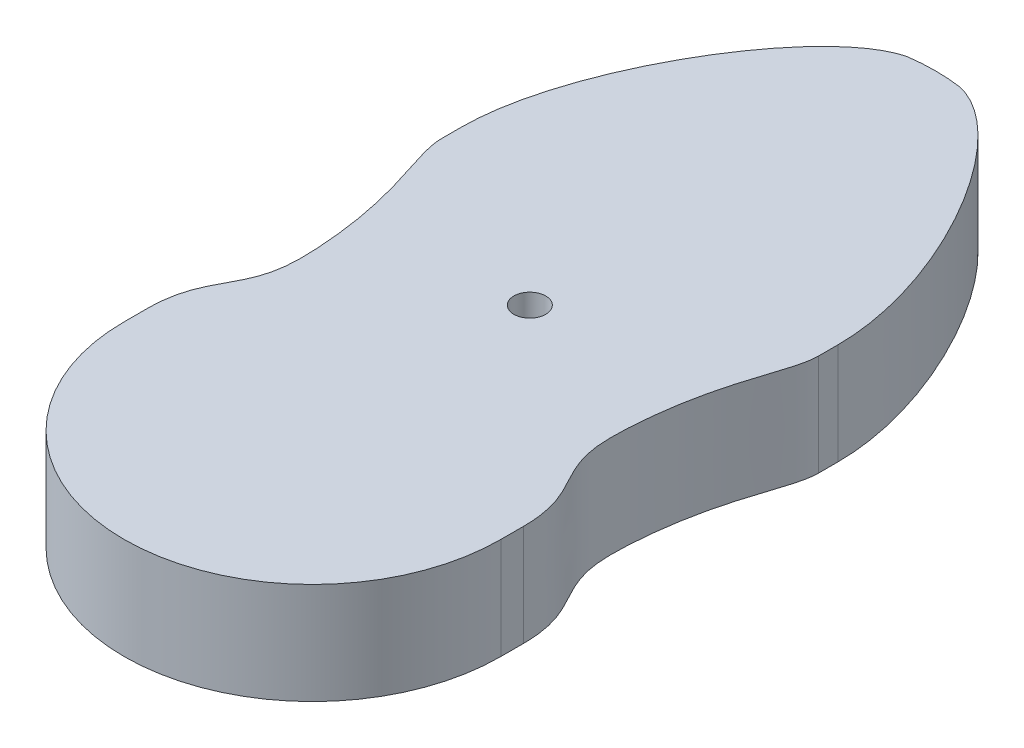
ISO-10303-21;
HEADER;
FILE_DESCRIPTION(('STEP AP214'),'2;1');
FILE_NAME('part.step','',(''),(''),'','','');
FILE_SCHEMA(('AUTOMOTIVE_DESIGN { 1 0 10303 214 1 1 1 1 }'));
ENDSEC;
DATA;
#1=APPLICATION_CONTEXT('core data for automotive mechanical design processes');
#2=APPLICATION_PROTOCOL_DEFINITION('international standard','automotive_design',2000,#1);
#3=PRODUCT_CONTEXT('',#1,'mechanical');
#4=PRODUCT('Part','Part','',(#3));
#5=PRODUCT_RELATED_PRODUCT_CATEGORY('part','',(#4));
#6=PRODUCT_DEFINITION_FORMATION('','',#4);
#7=PRODUCT_DEFINITION_CONTEXT('part definition',#1,'design');
#8=PRODUCT_DEFINITION('design','',#6,#7);
#9=PRODUCT_DEFINITION_SHAPE('','',#8);
#10=(LENGTH_UNIT() NAMED_UNIT(*) SI_UNIT(.MILLI.,.METRE.));
#11=(NAMED_UNIT(*) PLANE_ANGLE_UNIT() SI_UNIT($,.RADIAN.));
#12=(NAMED_UNIT(*) SI_UNIT($,.STERADIAN.) SOLID_ANGLE_UNIT());
#13=UNCERTAINTY_MEASURE_WITH_UNIT(LENGTH_MEASURE(1.E-05),#10,'distance_accuracy_value','');
#14=(GEOMETRIC_REPRESENTATION_CONTEXT(3) GLOBAL_UNCERTAINTY_ASSIGNED_CONTEXT((#13)) GLOBAL_UNIT_ASSIGNED_CONTEXT((#10,
#11,#12)) REPRESENTATION_CONTEXT('',''));
#15=CARTESIAN_POINT('',(0.,0.,0.));
#16=DIRECTION('',(0.,0.,1.));
#17=DIRECTION('',(1.,0.,0.));
#18=AXIS2_PLACEMENT_3D('',#15,#16,#17);
#19=CARTESIAN_POINT('',(65.,35.,-34.564378511684));
#20=CARTESIAN_POINT('',(65.,35.,-25.3044466184504));
#21=CARTESIAN_POINT('',(54.8759380217189,35.,-10.0008817095649));
#22=CARTESIAN_POINT('',(52.5082242131624,35.,44.6661183433651));
#23=CARTESIAN_POINT('',(65.0000000000032,35.,48.3308469707559));
#24=CARTESIAN_POINT('',(65.,35.,67.1772101581781));
#25=B_SPLINE_CURVE_WITH_KNOTS('',3,(#19,#20,#21,#22,#23,#24),.UNSPECIFIED.,.F.,.F.,(4,1,1,4),
(0.,0.557561401782111,0.65756140178211,1.),.UNSPECIFIED.);
#26=DIRECTION('',(0.,-1.,0.));
#27=VECTOR('',#26,1.);
#28=SURFACE_OF_LINEAR_EXTRUSION('',#25,#27);
#29=CARTESIAN_POINT('',(65.,0.,-34.564378511684));
#30=CARTESIAN_POINT('',(65.,0.,-25.3044466184504));
#31=CARTESIAN_POINT('',(54.8759380217189,0.,-10.0008817095649));
#32=CARTESIAN_POINT('',(52.5082242131624,0.,44.6661183433651));
#33=CARTESIAN_POINT('',(65.0000000000032,0.,48.3308469707559));
#34=CARTESIAN_POINT('',(65.,0.,67.1772101581781));
#35=B_SPLINE_CURVE_WITH_KNOTS('',3,(#29,#30,#31,#32,#33,#34),.UNSPECIFIED.,.F.,.F.,(4,1,1,4),
(0.,0.557561401782111,0.65756140178211,1.),.UNSPECIFIED.);
#36=CARTESIAN_POINT('',(65.0000000000001,0.,-34.564378511684));
#37=VERTEX_POINT('',#36);
#38=CARTESIAN_POINT('',(65.0000000000001,0.,67.1772101581781));
#39=VERTEX_POINT('',#38);
#40=EDGE_CURVE('E160',#37,#39,#35,.T.);
#41=ORIENTED_EDGE('',*,*,#40,.F.);
#42=DIRECTION('',(0.,-1.,0.));
#43=VECTOR('',#42,1.);
#44=CARTESIAN_POINT('',(65.0000000000001,35.,-34.564378511684));
#45=LINE('',#44,#43);
#46=CARTESIAN_POINT('',(65.0000000000001,35.,-34.564378511684));
#47=VERTEX_POINT('',#46);
#48=EDGE_CURVE('E11',#47,#37,#45,.T.);
#49=ORIENTED_EDGE('',*,*,#48,.F.);
#50=CARTESIAN_POINT('',(65.0000000000001,35.,67.1772101581781));
#51=VERTEX_POINT('',#50);
#52=EDGE_CURVE('E234',#47,#51,#25,.T.);
#53=ORIENTED_EDGE('',*,*,#52,.T.);
#54=DIRECTION('',(0.,-1.,0.));
#55=VECTOR('',#54,1.);
#56=CARTESIAN_POINT('',(65.0000000000001,35.,67.1772101581781));
#57=LINE('',#56,#55);
#58=EDGE_CURVE('E63',#51,#39,#57,.T.);
#59=ORIENTED_EDGE('',*,*,#58,.T.);
#60=EDGE_LOOP('',(#41,#49,#53,#59));
#61=FACE_BOUND('',#60,.T.);
#62=ADVANCED_FACE('F43',(#61),#28,.T.);
#63=CARTESIAN_POINT('',(65.0000000000001,35.,0.));
#64=DIRECTION('',(1.,0.,0.));
#65=DIRECTION('',(0.,0.,-1.));
#66=AXIS2_PLACEMENT_3D('',#63,#64,#65);
#67=PLANE('',#66);
#68=DIRECTION('',(0.,0.,1.));
#69=VECTOR('',#68,1.);
#70=CARTESIAN_POINT('',(65.0000000000001,0.,0.));
#71=LINE('',#70,#69);
#72=CARTESIAN_POINT('',(65.0000000000001,0.,-41.3132072498512));
#73=VERTEX_POINT('',#72);
#74=EDGE_CURVE('E165',#73,#37,#71,.T.);
#75=ORIENTED_EDGE('',*,*,#74,.F.);
#76=DIRECTION('',(0.,-1.,0.));
#77=VECTOR('',#76,1.);
#78=CARTESIAN_POINT('',(65.0000000000001,35.,-41.3132072498512));
#79=LINE('',#78,#77);
#80=CARTESIAN_POINT('',(65.0000000000001,35.,-41.3132072498512));
#81=VERTEX_POINT('',#80);
#82=EDGE_CURVE('E52',#81,#73,#79,.T.);
#83=ORIENTED_EDGE('',*,*,#82,.F.);
#84=DIRECTION('',(0.,0.,1.));
#85=VECTOR('',#84,1.);
#86=CARTESIAN_POINT('',(65.0000000000001,35.,0.));
#87=LINE('',#86,#85);
#88=EDGE_CURVE('E154',#81,#47,#87,.T.);
#89=ORIENTED_EDGE('',*,*,#88,.T.);
#90=ORIENTED_EDGE('',*,*,#48,.T.);
#91=EDGE_LOOP('',(#75,#83,#89,#90));
#92=FACE_BOUND('',#91,.T.);
#93=ADVANCED_FACE('F230',(#92),#67,.T.);
#94=CARTESIAN_POINT('',(65.,35.,-41.3132072498512));
#95=CARTESIAN_POINT('',(65.,35.,-81.2860596841783));
#96=CARTESIAN_POINT('',(28.4072122796697,35.,-139.74464823659));
#97=CARTESIAN_POINT('',(5.75591215379472,35.,-139.744648236588));
#98=B_SPLINE_CURVE_WITH_KNOTS('',3,(#94,#95,#96,#97),.UNSPECIFIED.,.F.,.F.,(4,4),(0.,1.),.UNSPECIFIED.);
#99=DIRECTION('',(0.,-1.,0.));
#100=VECTOR('',#99,1.);
#101=SURFACE_OF_LINEAR_EXTRUSION('',#98,#100);
#102=CARTESIAN_POINT('',(65.,0.,-41.3132072498512));
#103=CARTESIAN_POINT('',(65.,0.,-81.2860596841783));
#104=CARTESIAN_POINT('',(28.4072122796697,0.,-139.74464823659));
#105=CARTESIAN_POINT('',(5.75591215379472,0.,-139.744648236588));
#106=B_SPLINE_CURVE_WITH_KNOTS('',3,(#102,#103,#104,#105),.UNSPECIFIED.,.F.,.F.,(4,4),(0.,1.),.UNSPECIFIED.);
#107=CARTESIAN_POINT('',(8.99406307241884,0.,-139.374737509751));
#108=VERTEX_POINT('',#107);
#109=EDGE_CURVE('E172',#73,#108,#106,.T.);
#110=ORIENTED_EDGE('',*,*,#109,.T.);
#111=DIRECTION('',(0.,-1.,0.));
#112=VECTOR('',#111,1.);
#113=CARTESIAN_POINT('',(8.99406307241884,35.,-139.374737509751));
#114=LINE('',#113,#112);
#115=CARTESIAN_POINT('',(8.99406307241884,35.,-139.374737509751));
#116=VERTEX_POINT('',#115);
#117=EDGE_CURVE('E215',#116,#108,#114,.T.);
#118=ORIENTED_EDGE('',*,*,#117,.F.);
#119=EDGE_CURVE('E222',#81,#116,#98,.T.);
#120=ORIENTED_EDGE('',*,*,#119,.F.);
#121=ORIENTED_EDGE('',*,*,#82,.T.);
#122=EDGE_LOOP('',(#110,#118,#120,#121));
#123=FACE_BOUND('',#122,.T.);
#124=ADVANCED_FACE('F220',(#123),#101,.F.);
#125=CARTESIAN_POINT('',(0.,35.,-75.));
#126=DIRECTION('',(0.,-1.,0.));
#127=DIRECTION('',(0.,0.,-1.));
#128=AXIS2_PLACEMENT_3D('',#125,#126,#127);
#129=CYLINDRICAL_SURFACE('',#128,65.);
#130=CARTESIAN_POINT('',(0.,0.,-75.));
#131=DIRECTION('',(0.,1.,0.));
#132=DIRECTION('',(0.,0.,1.));
#133=AXIS2_PLACEMENT_3D('',#130,#131,#132);
#134=CIRCLE('',#133,65.);
#135=CARTESIAN_POINT('',(-8.99406307241938,0.,-139.374737509751));
#136=VERTEX_POINT('',#135);
#137=EDGE_CURVE('E177',#108,#136,#134,.T.);
#138=ORIENTED_EDGE('',*,*,#137,.T.);
#139=DIRECTION('',(0.,-1.,0.));
#140=VECTOR('',#139,1.);
#141=CARTESIAN_POINT('',(-8.99406307241938,35.,-139.374737509751));
#142=LINE('',#141,#140);
#143=CARTESIAN_POINT('',(-8.99406307241938,35.,-139.374737509751));
#144=VERTEX_POINT('',#143);
#145=EDGE_CURVE('E213',#144,#136,#142,.T.);
#146=ORIENTED_EDGE('',*,*,#145,.F.);
#147=CARTESIAN_POINT('',(0.,35.,-75.));
#148=DIRECTION('',(0.,1.,0.));
#149=DIRECTION('',(0.,0.,1.));
#150=AXIS2_PLACEMENT_3D('',#147,#148,#149);
#151=CIRCLE('',#150,65.);
#152=EDGE_CURVE('E249',#116,#144,#151,.T.);
#153=ORIENTED_EDGE('',*,*,#152,.F.);
#154=ORIENTED_EDGE('',*,*,#117,.T.);
#155=EDGE_LOOP('',(#138,#146,#153,#154));
#156=FACE_BOUND('',#155,.T.);
#157=ADVANCED_FACE('F256',(#156),#129,.T.);
#158=CARTESIAN_POINT('',(-65.,35.,-41.3132072498512));
#159=CARTESIAN_POINT('',(-65.,35.,-81.2860596841783));
#160=CARTESIAN_POINT('',(-28.4072122796697,35.,-139.74464823659));
#161=CARTESIAN_POINT('',(-5.75591215379472,35.,-139.744648236588));
#162=B_SPLINE_CURVE_WITH_KNOTS('',3,(#158,#159,#160,#161),.UNSPECIFIED.,.F.,.F.,(4,4),(0.,1.),.UNSPECIFIED.);
#163=DIRECTION('',(0.,-1.,0.));
#164=VECTOR('',#163,1.);
#165=SURFACE_OF_LINEAR_EXTRUSION('',#162,#164);
#166=CARTESIAN_POINT('',(-65.,0.,-41.3132072498512));
#167=CARTESIAN_POINT('',(-65.,0.,-81.2860596841783));
#168=CARTESIAN_POINT('',(-28.4072122796697,0.,-139.74464823659));
#169=CARTESIAN_POINT('',(-5.75591215379472,0.,-139.744648236588));
#170=B_SPLINE_CURVE_WITH_KNOTS('',3,(#166,#167,#168,#169),.UNSPECIFIED.,.F.,.F.,(4,4),(0.,1.),.UNSPECIFIED.);
#171=CARTESIAN_POINT('',(-65.,0.,-41.3132072498512));
#172=VERTEX_POINT('',#171);
#173=EDGE_CURVE('E183',#172,#136,#170,.T.);
#174=ORIENTED_EDGE('',*,*,#173,.F.);
#175=DIRECTION('',(0.,-1.,0.));
#176=VECTOR('',#175,1.);
#177=CARTESIAN_POINT('',(-65.,35.,-41.3132072498512));
#178=LINE('',#177,#176);
#179=CARTESIAN_POINT('',(-65.,35.,-41.3132072498512));
#180=VERTEX_POINT('',#179);
#181=EDGE_CURVE('E211',#180,#172,#178,.T.);
#182=ORIENTED_EDGE('',*,*,#181,.F.);
#183=EDGE_CURVE('E267',#180,#144,#162,.T.);
#184=ORIENTED_EDGE('',*,*,#183,.T.);
#185=ORIENTED_EDGE('',*,*,#145,.T.);
#186=EDGE_LOOP('',(#174,#182,#184,#185));
#187=FACE_BOUND('',#186,.T.);
#188=ADVANCED_FACE('F259',(#187),#165,.T.);
#189=CARTESIAN_POINT('',(-65.,35.,0.));
#190=DIRECTION('',(1.,0.,0.));
#191=DIRECTION('',(0.,0.,-1.));
#192=AXIS2_PLACEMENT_3D('',#189,#190,#191);
#193=PLANE('',#192);
#194=DIRECTION('',(0.,0.,1.));
#195=VECTOR('',#194,1.);
#196=CARTESIAN_POINT('',(-65.,0.,0.));
#197=LINE('',#196,#195);
#198=CARTESIAN_POINT('',(-65.,0.,-34.564378511684));
#199=VERTEX_POINT('',#198);
#200=EDGE_CURVE('E188',#172,#199,#197,.T.);
#201=ORIENTED_EDGE('',*,*,#200,.T.);
#202=DIRECTION('',(0.,-1.,0.));
#203=VECTOR('',#202,1.);
#204=CARTESIAN_POINT('',(-65.,35.,-34.564378511684));
#205=LINE('',#204,#203);
#206=CARTESIAN_POINT('',(-65.,35.,-34.564378511684));
#207=VERTEX_POINT('',#206);
#208=EDGE_CURVE('E208',#207,#199,#205,.T.);
#209=ORIENTED_EDGE('',*,*,#208,.F.);
#210=DIRECTION('',(0.,0.,1.));
#211=VECTOR('',#210,1.);
#212=CARTESIAN_POINT('',(-65.,35.,0.));
#213=LINE('',#212,#211);
#214=EDGE_CURVE('E138',#180,#207,#213,.T.);
#215=ORIENTED_EDGE('',*,*,#214,.F.);
#216=ORIENTED_EDGE('',*,*,#181,.T.);
#217=EDGE_LOOP('',(#201,#209,#215,#216));
#218=FACE_BOUND('',#217,.T.);
#219=ADVANCED_FACE('F263',(#218),#193,.F.);
#220=CARTESIAN_POINT('',(-65.,35.,-34.564378511684));
#221=CARTESIAN_POINT('',(-65.,35.,-25.3044466184504));
#222=CARTESIAN_POINT('',(-54.8759380217189,35.,-10.0008817095649));
#223=CARTESIAN_POINT('',(-52.5082242131624,35.,44.6661183433651));
#224=CARTESIAN_POINT('',(-65.0000000000032,35.,48.3308469707559));
#225=CARTESIAN_POINT('',(-65.,35.,67.1772101581781));
#226=B_SPLINE_CURVE_WITH_KNOTS('',3,(#220,#221,#222,#223,#224,#225),.UNSPECIFIED.,.F.,.F.,(4,1,
1,4),(0.,0.557561401782111,0.65756140178211,1.),.UNSPECIFIED.);
#227=DIRECTION('',(0.,-1.,0.));
#228=VECTOR('',#227,1.);
#229=SURFACE_OF_LINEAR_EXTRUSION('',#226,#228);
#230=CARTESIAN_POINT('',(-65.,0.,-34.564378511684));
#231=CARTESIAN_POINT('',(-65.,0.,-25.3044466184504));
#232=CARTESIAN_POINT('',(-54.8759380217189,0.,-10.0008817095649));
#233=CARTESIAN_POINT('',(-52.5082242131624,0.,44.6661183433651));
#234=CARTESIAN_POINT('',(-65.0000000000032,0.,48.3308469707559));
#235=CARTESIAN_POINT('',(-65.,0.,67.1772101581781));
#236=B_SPLINE_CURVE_WITH_KNOTS('',3,(#230,#231,#232,#233,#234,#235),.UNSPECIFIED.,.F.,.F.,(4,1,
1,4),(0.,0.557561401782111,0.65756140178211,1.),.UNSPECIFIED.);
#237=CARTESIAN_POINT('',(-65.,0.,67.1772101581781));
#238=VERTEX_POINT('',#237);
#239=EDGE_CURVE('E193',#199,#238,#236,.T.);
#240=ORIENTED_EDGE('',*,*,#239,.T.);
#241=DIRECTION('',(0.,-1.,0.));
#242=VECTOR('',#241,1.);
#243=CARTESIAN_POINT('',(-65.,35.,67.1772101581781));
#244=LINE('',#243,#242);
#245=CARTESIAN_POINT('',(-65.,35.,67.1772101581781));
#246=VERTEX_POINT('',#245);
#247=EDGE_CURVE('E146',#246,#238,#244,.T.);
#248=ORIENTED_EDGE('',*,*,#247,.F.);
#249=EDGE_CURVE('E133',#207,#246,#226,.T.);
#250=ORIENTED_EDGE('',*,*,#249,.F.);
#251=ORIENTED_EDGE('',*,*,#208,.T.);
#252=EDGE_LOOP('',(#240,#248,#250,#251));
#253=FACE_BOUND('',#252,.T.);
#254=ADVANCED_FACE('F265',(#253),#229,.F.);
#255=CARTESIAN_POINT('',(-65.,0.,75.));
#256=VERTEX_POINT('',#255);
#257=EDGE_CURVE('E143',#238,#256,#197,.T.);
#258=ORIENTED_EDGE('',*,*,#257,.T.);
#259=DIRECTION('',(0.,-1.,0.));
#260=VECTOR('',#259,1.);
#261=CARTESIAN_POINT('',(-65.,35.,75.));
#262=LINE('',#261,#260);
#263=CARTESIAN_POINT('',(-65.,35.,75.));
#264=VERTEX_POINT('',#263);
#265=EDGE_CURVE('E140',#264,#256,#262,.T.);
#266=ORIENTED_EDGE('',*,*,#265,.F.);
#267=EDGE_CURVE('E126',#246,#264,#213,.T.);
#268=ORIENTED_EDGE('',*,*,#267,.F.);
#269=ORIENTED_EDGE('',*,*,#247,.T.);
#270=EDGE_LOOP('',(#258,#266,#268,#269));
#271=FACE_BOUND('',#270,.T.);
#272=ADVANCED_FACE('F141',(#271),#193,.F.);
#273=CARTESIAN_POINT('',(0.,35.,75.));
#274=DIRECTION('',(0.,-1.,0.));
#275=DIRECTION('',(0.,0.,-1.));
#276=AXIS2_PLACEMENT_3D('',#273,#274,#275);
#277=CYLINDRICAL_SURFACE('',#276,65.);
#278=CARTESIAN_POINT('',(0.,0.,75.));
#279=DIRECTION('',(0.,1.,0.));
#280=DIRECTION('',(0.,0.,1.));
#281=AXIS2_PLACEMENT_3D('',#278,#279,#280);
#282=CIRCLE('',#281,65.);
#283=CARTESIAN_POINT('',(65.0000000000001,0.,75.));
#284=VERTEX_POINT('',#283);
#285=EDGE_CURVE('E197',#256,#284,#282,.T.);
#286=ORIENTED_EDGE('',*,*,#285,.T.);
#287=DIRECTION('',(0.,-1.,0.));
#288=VECTOR('',#287,1.);
#289=CARTESIAN_POINT('',(65.0000000000001,35.,75.));
#290=LINE('',#289,#288);
#291=CARTESIAN_POINT('',(65.0000000000001,35.,75.));
#292=VERTEX_POINT('',#291);
#293=EDGE_CURVE('E96',#292,#284,#290,.T.);
#294=ORIENTED_EDGE('',*,*,#293,.F.);
#295=CARTESIAN_POINT('',(0.,35.,75.));
#296=DIRECTION('',(0.,1.,0.));
#297=DIRECTION('',(0.,0.,1.));
#298=AXIS2_PLACEMENT_3D('',#295,#296,#297);
#299=CIRCLE('',#298,65.);
#300=EDGE_CURVE('E131',#264,#292,#299,.T.);
#301=ORIENTED_EDGE('',*,*,#300,.F.);
#302=ORIENTED_EDGE('',*,*,#265,.T.);
#303=EDGE_LOOP('',(#286,#294,#301,#302));
#304=FACE_BOUND('',#303,.T.);
#305=ADVANCED_FACE('F148',(#304),#277,.T.);
#306=EDGE_CURVE('E173',#39,#284,#71,.T.);
#307=ORIENTED_EDGE('',*,*,#306,.F.);
#308=ORIENTED_EDGE('',*,*,#58,.F.);
#309=EDGE_CURVE('E150',#51,#292,#87,.T.);
#310=ORIENTED_EDGE('',*,*,#309,.T.);
#311=ORIENTED_EDGE('',*,*,#293,.T.);
#312=EDGE_LOOP('',(#307,#308,#310,#311));
#313=FACE_BOUND('',#312,.T.);
#314=ADVANCED_FACE('F232',(#313),#67,.T.);
#315=CARTESIAN_POINT('',(0.,35.,0.));
#316=DIRECTION('',(0.,1.,0.));
#317=DIRECTION('',(0.,0.,1.));
#318=AXIS2_PLACEMENT_3D('',#315,#316,#317);
#319=PLANE('',#318);
#320=CARTESIAN_POINT('',(0.,35.,0.));
#321=DIRECTION('',(0.,1.,0.));
#322=DIRECTION('',(0.,0.,1.));
#323=AXIS2_PLACEMENT_3D('',#320,#321,#322);
#324=CIRCLE('',#323,5.5);
#325=CARTESIAN_POINT('',(0.,35.,5.5));
#326=VERTEX_POINT('',#325);
#327=EDGE_CURVE('E364',#326,#326,#324,.T.);
#328=ORIENTED_EDGE('',*,*,#327,.F.);
#329=EDGE_LOOP('',(#328));
#330=FACE_BOUND('',#329,.T.);
#331=ORIENTED_EDGE('',*,*,#52,.F.);
#332=ORIENTED_EDGE('',*,*,#88,.F.);
#333=ORIENTED_EDGE('',*,*,#119,.T.);
#334=ORIENTED_EDGE('',*,*,#152,.T.);
#335=ORIENTED_EDGE('',*,*,#183,.F.);
#336=ORIENTED_EDGE('',*,*,#214,.T.);
#337=ORIENTED_EDGE('',*,*,#249,.T.);
#338=ORIENTED_EDGE('',*,*,#267,.T.);
#339=ORIENTED_EDGE('',*,*,#300,.T.);
#340=ORIENTED_EDGE('',*,*,#309,.F.);
#341=EDGE_LOOP('',(#331,#332,#333,#334,#335,#336,#337,#338,#339,#340));
#342=FACE_BOUND('',#341,.T.);
#343=ADVANCED_FACE('F128',(#330,#342),#319,.T.);
#344=CARTESIAN_POINT('',(0.,0.,0.));
#345=DIRECTION('',(0.,1.,0.));
#346=DIRECTION('',(0.,0.,1.));
#347=AXIS2_PLACEMENT_3D('',#344,#345,#346);
#348=PLANE('',#347);
#349=CARTESIAN_POINT('',(0.,0.,0.));
#350=DIRECTION('',(0.,1.,0.));
#351=DIRECTION('',(0.,0.,1.));
#352=AXIS2_PLACEMENT_3D('',#349,#350,#351);
#353=CIRCLE('',#352,5.49999999999999);
#354=CARTESIAN_POINT('',(0.,0.,5.49999999999999));
#355=VERTEX_POINT('',#354);
#356=EDGE_CURVE('E166',#355,#355,#353,.T.);
#357=ORIENTED_EDGE('',*,*,#356,.T.);
#358=EDGE_LOOP('',(#357));
#359=FACE_BOUND('',#358,.T.);
#360=ORIENTED_EDGE('',*,*,#40,.T.);
#361=ORIENTED_EDGE('',*,*,#306,.T.);
#362=ORIENTED_EDGE('',*,*,#285,.F.);
#363=ORIENTED_EDGE('',*,*,#257,.F.);
#364=ORIENTED_EDGE('',*,*,#239,.F.);
#365=ORIENTED_EDGE('',*,*,#200,.F.);
#366=ORIENTED_EDGE('',*,*,#173,.T.);
#367=ORIENTED_EDGE('',*,*,#137,.F.);
#368=ORIENTED_EDGE('',*,*,#109,.F.);
#369=ORIENTED_EDGE('',*,*,#74,.T.);
#370=EDGE_LOOP('',(#360,#361,#362,#363,#364,#365,#366,#367,#368,#369));
#371=FACE_BOUND('',#370,.T.);
#372=ADVANCED_FACE('F229',(#359,#371),#348,.F.);
#373=CARTESIAN_POINT('',(0.,35.,0.));
#374=DIRECTION('',(0.,1.,0.));
#375=DIRECTION('',(0.,0.,1.));
#376=AXIS2_PLACEMENT_3D('',#373,#374,#375);
#377=CYLINDRICAL_SURFACE('',#376,5.49999999999999);
#378=ORIENTED_EDGE('',*,*,#356,.F.);
#379=EDGE_LOOP('',(#378));
#380=FACE_BOUND('',#379,.T.);
#381=ORIENTED_EDGE('',*,*,#327,.T.);
#382=EDGE_LOOP('',(#381));
#383=FACE_BOUND('',#382,.T.);
#384=ADVANCED_FACE('F350',(#380,#383),#377,.F.);
#385=CLOSED_SHELL('',(#62,#93,#124,#157,#188,#219,#254,#272,#305,#314,#343,#372,#384));
#386=MANIFOLD_SOLID_BREP('B2',#385);
#387=ADVANCED_BREP_SHAPE_REPRESENTATION('',(#18,#386),#14);
#388=SHAPE_DEFINITION_REPRESENTATION(#9,#387);
ENDSEC;
END-ISO-10303-21;
